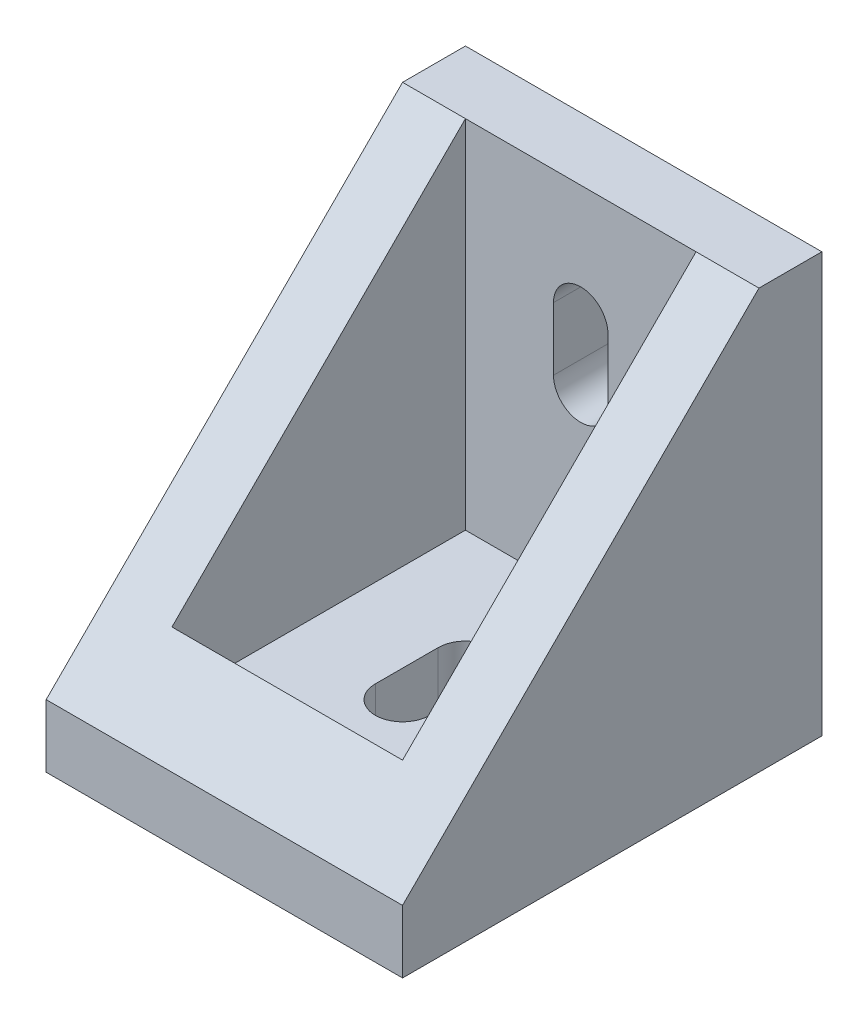
ISO-10303-21;
HEADER;
FILE_DESCRIPTION(('STEP AP214'),'2;1');
FILE_NAME('part.step','',(''),(''),'','','');
FILE_SCHEMA(('AUTOMOTIVE_DESIGN { 1 0 10303 214 1 1 1 1 }'));
ENDSEC;
DATA;
#1=APPLICATION_CONTEXT('core data for automotive mechanical design processes');
#2=APPLICATION_PROTOCOL_DEFINITION('international standard','automotive_design',2000,#1);
#3=PRODUCT_CONTEXT('',#1,'mechanical');
#4=PRODUCT('Part','Part','',(#3));
#5=PRODUCT_RELATED_PRODUCT_CATEGORY('part','',(#4));
#6=PRODUCT_DEFINITION_FORMATION('','',#4);
#7=PRODUCT_DEFINITION_CONTEXT('part definition',#1,'design');
#8=PRODUCT_DEFINITION('design','',#6,#7);
#9=PRODUCT_DEFINITION_SHAPE('','',#8);
#10=(LENGTH_UNIT() NAMED_UNIT(*) SI_UNIT(.MILLI.,.METRE.));
#11=(NAMED_UNIT(*) PLANE_ANGLE_UNIT() SI_UNIT($,.RADIAN.));
#12=(NAMED_UNIT(*) SI_UNIT($,.STERADIAN.) SOLID_ANGLE_UNIT());
#13=UNCERTAINTY_MEASURE_WITH_UNIT(LENGTH_MEASURE(1.E-05),#10,'distance_accuracy_value','');
#14=(GEOMETRIC_REPRESENTATION_CONTEXT(3) GLOBAL_UNCERTAINTY_ASSIGNED_CONTEXT((#13)) GLOBAL_UNIT_ASSIGNED_CONTEXT((#10,
#11,#12)) REPRESENTATION_CONTEXT('',''));
#15=CARTESIAN_POINT('',(0.,0.,0.));
#16=DIRECTION('',(0.,0.,1.));
#17=DIRECTION('',(1.,0.,0.));
#18=AXIS2_PLACEMENT_3D('',#15,#16,#17);
#19=CARTESIAN_POINT('',(8.5,20.,-10.));
#20=DIRECTION('',(-1.,0.,0.));
#21=DIRECTION('',(0.,0.,1.));
#22=AXIS2_PLACEMENT_3D('',#19,#20,#21);
#23=PLANE('',#22);
#24=DIRECTION('',(0.,0.,-1.));
#25=VECTOR('',#24,1.);
#26=CARTESIAN_POINT('',(8.5,20.,-10.));
#27=LINE('',#26,#25);
#28=CARTESIAN_POINT('',(8.5,20.,-7.));
#29=VERTEX_POINT('',#28);
#30=CARTESIAN_POINT('',(8.5,20.,-10.));
#31=VERTEX_POINT('',#30);
#32=EDGE_CURVE('E259',#29,#31,#27,.T.);
#33=ORIENTED_EDGE('',*,*,#32,.F.);
#34=DIRECTION('',(0.,0.707106781186547,-0.707106781186547));
#35=VECTOR('',#34,1.);
#36=CARTESIAN_POINT('',(8.5,3.,10.));
#37=LINE('',#36,#35);
#38=CARTESIAN_POINT('',(8.5,3.,10.));
#39=VERTEX_POINT('',#38);
#40=EDGE_CURVE('E213',#39,#29,#37,.T.);
#41=ORIENTED_EDGE('',*,*,#40,.F.);
#42=DIRECTION('',(0.,-1.,0.));
#43=VECTOR('',#42,1.);
#44=CARTESIAN_POINT('',(8.5,20.,10.));
#45=LINE('',#44,#43);
#46=CARTESIAN_POINT('',(8.5,0.,10.));
#47=VERTEX_POINT('',#46);
#48=EDGE_CURVE('E267',#39,#47,#45,.T.);
#49=ORIENTED_EDGE('',*,*,#48,.T.);
#50=DIRECTION('',(0.,0.,-1.));
#51=VECTOR('',#50,1.);
#52=CARTESIAN_POINT('',(8.5,0.,-10.));
#53=LINE('',#52,#51);
#54=CARTESIAN_POINT('',(8.5,0.,-10.));
#55=VERTEX_POINT('',#54);
#56=EDGE_CURVE('E241',#47,#55,#53,.T.);
#57=ORIENTED_EDGE('',*,*,#56,.T.);
#58=DIRECTION('',(0.,-1.,0.));
#59=VECTOR('',#58,1.);
#60=CARTESIAN_POINT('',(8.5,20.,-10.));
#61=LINE('',#60,#59);
#62=EDGE_CURVE('E41',#31,#55,#61,.T.);
#63=ORIENTED_EDGE('',*,*,#62,.F.);
#64=EDGE_LOOP('',(#33,#41,#49,#57,#63));
#65=FACE_BOUND('',#64,.T.);
#66=ADVANCED_FACE('F34',(#65),#23,.F.);
#67=CARTESIAN_POINT('',(-8.5,20.,-10.));
#68=DIRECTION('',(0.,0.,1.));
#69=DIRECTION('',(1.,0.,0.));
#70=AXIS2_PLACEMENT_3D('',#67,#68,#69);
#71=PLANE('',#70);
#72=DIRECTION('',(0.,1.,0.));
#73=VECTOR('',#72,1.);
#74=CARTESIAN_POINT('',(1.3,14.5,-10.));
#75=LINE('',#74,#73);
#76=CARTESIAN_POINT('',(1.3,11.5,-10.));
#77=VERTEX_POINT('',#76);
#78=CARTESIAN_POINT('',(1.3,14.5,-10.));
#79=VERTEX_POINT('',#78);
#80=EDGE_CURVE('E159',#77,#79,#75,.T.);
#81=ORIENTED_EDGE('',*,*,#80,.T.);
#82=CARTESIAN_POINT('',(0.,14.5,-10.));
#83=DIRECTION('',(0.,0.,1.));
#84=DIRECTION('',(1.,0.,0.));
#85=AXIS2_PLACEMENT_3D('',#82,#83,#84);
#86=CIRCLE('',#85,1.3);
#87=CARTESIAN_POINT('',(-1.3,14.5,-10.));
#88=VERTEX_POINT('',#87);
#89=EDGE_CURVE('E153',#79,#88,#86,.T.);
#90=ORIENTED_EDGE('',*,*,#89,.T.);
#91=DIRECTION('',(0.,-1.,0.));
#92=VECTOR('',#91,1.);
#93=CARTESIAN_POINT('',(-1.3,14.5,-10.));
#94=LINE('',#93,#92);
#95=CARTESIAN_POINT('',(-1.3,11.5,-10.));
#96=VERTEX_POINT('',#95);
#97=EDGE_CURVE('E162',#88,#96,#94,.T.);
#98=ORIENTED_EDGE('',*,*,#97,.T.);
#99=CARTESIAN_POINT('',(0.,11.5,-10.));
#100=DIRECTION('',(0.,0.,1.));
#101=DIRECTION('',(1.,0.,0.));
#102=AXIS2_PLACEMENT_3D('',#99,#100,#101);
#103=CIRCLE('',#102,1.3);
#104=EDGE_CURVE('E48',#96,#77,#103,.T.);
#105=ORIENTED_EDGE('',*,*,#104,.T.);
#106=EDGE_LOOP('',(#81,#90,#98,#105));
#107=FACE_BOUND('',#106,.T.);
#108=DIRECTION('',(-1.,0.,0.));
#109=VECTOR('',#108,1.);
#110=CARTESIAN_POINT('',(-8.5,0.,-10.));
#111=LINE('',#110,#109);
#112=CARTESIAN_POINT('',(-8.5,0.,-10.));
#113=VERTEX_POINT('',#112);
#114=EDGE_CURVE('E270',#55,#113,#111,.T.);
#115=ORIENTED_EDGE('',*,*,#114,.T.);
#116=DIRECTION('',(0.,-1.,0.));
#117=VECTOR('',#116,1.);
#118=CARTESIAN_POINT('',(-8.5,20.,-10.));
#119=LINE('',#118,#117);
#120=CARTESIAN_POINT('',(-8.5,20.,-10.));
#121=VERTEX_POINT('',#120);
#122=EDGE_CURVE('E280',#121,#113,#119,.T.);
#123=ORIENTED_EDGE('',*,*,#122,.F.);
#124=DIRECTION('',(-1.,0.,0.));
#125=VECTOR('',#124,1.);
#126=CARTESIAN_POINT('',(-8.5,20.,-10.));
#127=LINE('',#126,#125);
#128=EDGE_CURVE('E261',#31,#121,#127,.T.);
#129=ORIENTED_EDGE('',*,*,#128,.F.);
#130=ORIENTED_EDGE('',*,*,#62,.T.);
#131=EDGE_LOOP('',(#115,#123,#129,#130));
#132=FACE_BOUND('',#131,.T.);
#133=ADVANCED_FACE('F166',(#107,#132),#71,.F.);
#134=CARTESIAN_POINT('',(-8.5,20.,-10.));
#135=DIRECTION('',(1.,0.,0.));
#136=DIRECTION('',(0.,0.,-1.));
#137=AXIS2_PLACEMENT_3D('',#134,#135,#136);
#138=PLANE('',#137);
#139=DIRECTION('',(0.,-1.,0.));
#140=VECTOR('',#139,1.);
#141=CARTESIAN_POINT('',(-8.5,20.,10.));
#142=LINE('',#141,#140);
#143=CARTESIAN_POINT('',(-8.5,3.,10.));
#144=VERTEX_POINT('',#143);
#145=CARTESIAN_POINT('',(-8.5,0.,10.));
#146=VERTEX_POINT('',#145);
#147=EDGE_CURVE('E278',#144,#146,#142,.T.);
#148=ORIENTED_EDGE('',*,*,#147,.F.);
#149=DIRECTION('',(0.,0.707106781186547,-0.707106781186547));
#150=VECTOR('',#149,1.);
#151=CARTESIAN_POINT('',(-8.5,3.,10.));
#152=LINE('',#151,#150);
#153=CARTESIAN_POINT('',(-8.5,20.,-7.));
#154=VERTEX_POINT('',#153);
#155=EDGE_CURVE('E220',#144,#154,#152,.T.);
#156=ORIENTED_EDGE('',*,*,#155,.T.);
#157=DIRECTION('',(0.,0.,1.));
#158=VECTOR('',#157,1.);
#159=CARTESIAN_POINT('',(-8.5,20.,-10.));
#160=LINE('',#159,#158);
#161=EDGE_CURVE('E264',#121,#154,#160,.T.);
#162=ORIENTED_EDGE('',*,*,#161,.F.);
#163=ORIENTED_EDGE('',*,*,#122,.T.);
#164=DIRECTION('',(0.,0.,1.));
#165=VECTOR('',#164,1.);
#166=CARTESIAN_POINT('',(-8.5,0.,-10.));
#167=LINE('',#166,#165);
#168=EDGE_CURVE('E272',#113,#146,#167,.T.);
#169=ORIENTED_EDGE('',*,*,#168,.T.);
#170=EDGE_LOOP('',(#148,#156,#162,#163,#169));
#171=FACE_BOUND('',#170,.T.);
#172=ADVANCED_FACE('F297',(#171),#138,.F.);
#173=CARTESIAN_POINT('',(-8.5,20.,10.));
#174=DIRECTION('',(0.,0.,-1.));
#175=DIRECTION('',(-1.,0.,0.));
#176=AXIS2_PLACEMENT_3D('',#173,#174,#175);
#177=PLANE('',#176);
#178=ORIENTED_EDGE('',*,*,#48,.F.);
#179=DIRECTION('',(1.,0.,0.));
#180=VECTOR('',#179,1.);
#181=CARTESIAN_POINT('',(-8.5,3.,10.));
#182=LINE('',#181,#180);
#183=EDGE_CURVE('E225',#144,#39,#182,.T.);
#184=ORIENTED_EDGE('',*,*,#183,.F.);
#185=ORIENTED_EDGE('',*,*,#147,.T.);
#186=DIRECTION('',(1.,0.,0.));
#187=VECTOR('',#186,1.);
#188=CARTESIAN_POINT('',(-8.5,0.,10.));
#189=LINE('',#188,#187);
#190=EDGE_CURVE('E262',#146,#47,#189,.T.);
#191=ORIENTED_EDGE('',*,*,#190,.T.);
#192=EDGE_LOOP('',(#178,#184,#185,#191));
#193=FACE_BOUND('',#192,.T.);
#194=ADVANCED_FACE('F306',(#193),#177,.F.);
#195=CARTESIAN_POINT('',(0.,20.,0.));
#196=DIRECTION('',(0.,1.,0.));
#197=DIRECTION('',(0.,0.,1.));
#198=AXIS2_PLACEMENT_3D('',#195,#196,#197);
#199=PLANE('',#198);
#200=DIRECTION('',(1.,0.,0.));
#201=VECTOR('',#200,1.);
#202=CARTESIAN_POINT('',(-8.5,20.,-7.));
#203=LINE('',#202,#201);
#204=CARTESIAN_POINT('',(5.5,20.,-7.));
#205=VERTEX_POINT('',#204);
#206=EDGE_CURVE('E223',#205,#29,#203,.T.);
#207=ORIENTED_EDGE('',*,*,#206,.T.);
#208=ORIENTED_EDGE('',*,*,#32,.T.);
#209=ORIENTED_EDGE('',*,*,#128,.T.);
#210=ORIENTED_EDGE('',*,*,#161,.T.);
#211=CARTESIAN_POINT('',(-5.5,20.,-7.));
#212=VERTEX_POINT('',#211);
#213=EDGE_CURVE('E228',#154,#212,#203,.T.);
#214=ORIENTED_EDGE('',*,*,#213,.T.);
#215=DIRECTION('',(-1.,0.,0.));
#216=VECTOR('',#215,1.);
#217=CARTESIAN_POINT('',(-8.5,20.,-7.));
#218=LINE('',#217,#216);
#219=EDGE_CURVE('E246',#205,#212,#218,.T.);
#220=ORIENTED_EDGE('',*,*,#219,.F.);
#221=EDGE_LOOP('',(#207,#208,#209,#210,#214,#220));
#222=FACE_BOUND('',#221,.T.);
#223=ADVANCED_FACE('F301',(#222),#199,.T.);
#224=CARTESIAN_POINT('',(0.,0.,0.));
#225=DIRECTION('',(0.,1.,0.));
#226=DIRECTION('',(0.,0.,1.));
#227=AXIS2_PLACEMENT_3D('',#224,#225,#226);
#228=PLANE('',#227);
#229=DIRECTION('',(0.,0.,-1.));
#230=VECTOR('',#229,1.);
#231=CARTESIAN_POINT('',(1.3,0.,-1.5));
#232=LINE('',#231,#230);
#233=CARTESIAN_POINT('',(1.3,0.,1.5));
#234=VERTEX_POINT('',#233);
#235=CARTESIAN_POINT('',(1.3,0.,-1.5));
#236=VERTEX_POINT('',#235);
#237=EDGE_CURVE('E198',#234,#236,#232,.T.);
#238=ORIENTED_EDGE('',*,*,#237,.T.);
#239=CARTESIAN_POINT('',(0.,0.,-1.5));
#240=DIRECTION('',(0.,1.,0.));
#241=DIRECTION('',(0.,0.,1.));
#242=AXIS2_PLACEMENT_3D('',#239,#240,#241);
#243=CIRCLE('',#242,1.3);
#244=CARTESIAN_POINT('',(-1.3,0.,-1.5));
#245=VERTEX_POINT('',#244);
#246=EDGE_CURVE('E188',#236,#245,#243,.T.);
#247=ORIENTED_EDGE('',*,*,#246,.T.);
#248=DIRECTION('',(0.,0.,1.));
#249=VECTOR('',#248,1.);
#250=CARTESIAN_POINT('',(-1.3,0.,-1.5));
#251=LINE('',#250,#249);
#252=CARTESIAN_POINT('',(-1.3,0.,1.5));
#253=VERTEX_POINT('',#252);
#254=EDGE_CURVE('E191',#245,#253,#251,.T.);
#255=ORIENTED_EDGE('',*,*,#254,.T.);
#256=CARTESIAN_POINT('',(0.,0.,1.5));
#257=DIRECTION('',(0.,1.,0.));
#258=DIRECTION('',(0.,0.,1.));
#259=AXIS2_PLACEMENT_3D('',#256,#257,#258);
#260=CIRCLE('',#259,1.3);
#261=EDGE_CURVE('E195',#253,#234,#260,.T.);
#262=ORIENTED_EDGE('',*,*,#261,.T.);
#263=EDGE_LOOP('',(#238,#247,#255,#262));
#264=FACE_BOUND('',#263,.T.);
#265=ORIENTED_EDGE('',*,*,#56,.F.);
#266=ORIENTED_EDGE('',*,*,#190,.F.);
#267=ORIENTED_EDGE('',*,*,#168,.F.);
#268=ORIENTED_EDGE('',*,*,#114,.F.);
#269=EDGE_LOOP('',(#265,#266,#267,#268));
#270=FACE_BOUND('',#269,.T.);
#271=ADVANCED_FACE('F293',(#264,#270),#228,.F.);
#272=CARTESIAN_POINT('',(5.5,20.,-10.));
#273=DIRECTION('',(-1.,0.,0.));
#274=DIRECTION('',(0.,0.,1.));
#275=AXIS2_PLACEMENT_3D('',#272,#273,#274);
#276=PLANE('',#275);
#277=DIRECTION('',(0.,-0.707106781186548,0.707106781186548));
#278=VECTOR('',#277,1.);
#279=CARTESIAN_POINT('',(5.5,21.5,-8.5));
#280=LINE('',#279,#278);
#281=CARTESIAN_POINT('',(5.5,6.,7.));
#282=VERTEX_POINT('',#281);
#283=EDGE_CURVE('E232',#205,#282,#280,.T.);
#284=ORIENTED_EDGE('',*,*,#283,.F.);
#285=DIRECTION('',(0.,-1.,0.));
#286=VECTOR('',#285,1.);
#287=CARTESIAN_POINT('',(5.5,20.,-7.));
#288=LINE('',#287,#286);
#289=CARTESIAN_POINT('',(5.5,3.,-7.));
#290=VERTEX_POINT('',#289);
#291=EDGE_CURVE('E238',#205,#290,#288,.T.);
#292=ORIENTED_EDGE('',*,*,#291,.T.);
#293=DIRECTION('',(0.,0.,-1.));
#294=VECTOR('',#293,1.);
#295=CARTESIAN_POINT('',(5.5,3.,-10.));
#296=LINE('',#295,#294);
#297=CARTESIAN_POINT('',(5.5,3.,7.));
#298=VERTEX_POINT('',#297);
#299=EDGE_CURVE('E234',#298,#290,#296,.T.);
#300=ORIENTED_EDGE('',*,*,#299,.F.);
#301=DIRECTION('',(0.,-1.,0.));
#302=VECTOR('',#301,1.);
#303=CARTESIAN_POINT('',(5.5,20.,7.));
#304=LINE('',#303,#302);
#305=EDGE_CURVE('E243',#282,#298,#304,.T.);
#306=ORIENTED_EDGE('',*,*,#305,.F.);
#307=EDGE_LOOP('',(#284,#292,#300,#306));
#308=FACE_BOUND('',#307,.T.);
#309=ADVANCED_FACE('F324',(#308),#276,.T.);
#310=CARTESIAN_POINT('',(-8.5,20.,-7.));
#311=DIRECTION('',(0.,0.,1.));
#312=DIRECTION('',(1.,0.,0.));
#313=AXIS2_PLACEMENT_3D('',#310,#311,#312);
#314=PLANE('',#313);
#315=CARTESIAN_POINT('',(0.,14.5,-7.));
#316=DIRECTION('',(0.,0.,1.));
#317=DIRECTION('',(1.,0.,0.));
#318=AXIS2_PLACEMENT_3D('',#315,#316,#317);
#319=CIRCLE('',#318,1.3);
#320=CARTESIAN_POINT('',(1.3,14.5,-7.));
#321=VERTEX_POINT('',#320);
#322=CARTESIAN_POINT('',(-1.3,14.5,-7.));
#323=VERTEX_POINT('',#322);
#324=EDGE_CURVE('E56',#321,#323,#319,.T.);
#325=ORIENTED_EDGE('',*,*,#324,.F.);
#326=DIRECTION('',(0.,1.,0.));
#327=VECTOR('',#326,1.);
#328=CARTESIAN_POINT('',(1.3,14.5,-7.));
#329=LINE('',#328,#327);
#330=CARTESIAN_POINT('',(1.3,11.5,-7.));
#331=VERTEX_POINT('',#330);
#332=EDGE_CURVE('E169',#331,#321,#329,.T.);
#333=ORIENTED_EDGE('',*,*,#332,.F.);
#334=CARTESIAN_POINT('',(0.,11.5,-7.));
#335=DIRECTION('',(0.,0.,1.));
#336=DIRECTION('',(1.,0.,0.));
#337=AXIS2_PLACEMENT_3D('',#334,#335,#336);
#338=CIRCLE('',#337,1.3);
#339=CARTESIAN_POINT('',(-1.3,11.5,-7.));
#340=VERTEX_POINT('',#339);
#341=EDGE_CURVE('E172',#340,#331,#338,.T.);
#342=ORIENTED_EDGE('',*,*,#341,.F.);
#343=DIRECTION('',(0.,-1.,0.));
#344=VECTOR('',#343,1.);
#345=CARTESIAN_POINT('',(-1.3,14.5,-7.));
#346=LINE('',#345,#344);
#347=EDGE_CURVE('E178',#323,#340,#346,.T.);
#348=ORIENTED_EDGE('',*,*,#347,.F.);
#349=EDGE_LOOP('',(#325,#333,#342,#348));
#350=FACE_BOUND('',#349,.T.);
#351=DIRECTION('',(-1.,0.,0.));
#352=VECTOR('',#351,1.);
#353=CARTESIAN_POINT('',(-8.5,3.,-7.));
#354=LINE('',#353,#352);
#355=CARTESIAN_POINT('',(-5.5,3.,-7.));
#356=VERTEX_POINT('',#355);
#357=EDGE_CURVE('E237',#290,#356,#354,.T.);
#358=ORIENTED_EDGE('',*,*,#357,.F.);
#359=ORIENTED_EDGE('',*,*,#291,.F.);
#360=ORIENTED_EDGE('',*,*,#219,.T.);
#361=DIRECTION('',(0.,-1.,0.));
#362=VECTOR('',#361,1.);
#363=CARTESIAN_POINT('',(-5.5,20.,-7.));
#364=LINE('',#363,#362);
#365=EDGE_CURVE('E242',#212,#356,#364,.T.);
#366=ORIENTED_EDGE('',*,*,#365,.T.);
#367=EDGE_LOOP('',(#358,#359,#360,#366));
#368=FACE_BOUND('',#367,.T.);
#369=ADVANCED_FACE('F327',(#350,#368),#314,.T.);
#370=CARTESIAN_POINT('',(-5.5,20.,-10.));
#371=DIRECTION('',(1.,0.,0.));
#372=DIRECTION('',(0.,0.,-1.));
#373=AXIS2_PLACEMENT_3D('',#370,#371,#372);
#374=PLANE('',#373);
#375=DIRECTION('',(0.,0.707106781186548,-0.707106781186548));
#376=VECTOR('',#375,1.);
#377=CARTESIAN_POINT('',(-5.5,21.5,-8.5));
#378=LINE('',#377,#376);
#379=CARTESIAN_POINT('',(-5.5,6.,7.));
#380=VERTEX_POINT('',#379);
#381=EDGE_CURVE('E227',#380,#212,#378,.T.);
#382=ORIENTED_EDGE('',*,*,#381,.F.);
#383=DIRECTION('',(0.,-1.,0.));
#384=VECTOR('',#383,1.);
#385=CARTESIAN_POINT('',(-5.5,20.,7.));
#386=LINE('',#385,#384);
#387=CARTESIAN_POINT('',(-5.5,3.,7.));
#388=VERTEX_POINT('',#387);
#389=EDGE_CURVE('E245',#380,#388,#386,.T.);
#390=ORIENTED_EDGE('',*,*,#389,.T.);
#391=DIRECTION('',(0.,0.,1.));
#392=VECTOR('',#391,1.);
#393=CARTESIAN_POINT('',(-5.5,3.,-10.));
#394=LINE('',#393,#392);
#395=EDGE_CURVE('E248',#356,#388,#394,.T.);
#396=ORIENTED_EDGE('',*,*,#395,.F.);
#397=ORIENTED_EDGE('',*,*,#365,.F.);
#398=EDGE_LOOP('',(#382,#390,#396,#397));
#399=FACE_BOUND('',#398,.T.);
#400=ADVANCED_FACE('F313',(#399),#374,.T.);
#401=CARTESIAN_POINT('',(-8.5,20.,7.));
#402=DIRECTION('',(0.,0.,-1.));
#403=DIRECTION('',(-1.,0.,0.));
#404=AXIS2_PLACEMENT_3D('',#401,#402,#403);
#405=PLANE('',#404);
#406=DIRECTION('',(-1.,0.,0.));
#407=VECTOR('',#406,1.);
#408=CARTESIAN_POINT('',(-8.5,6.,7.));
#409=LINE('',#408,#407);
#410=EDGE_CURVE('E11',#282,#380,#409,.T.);
#411=ORIENTED_EDGE('',*,*,#410,.F.);
#412=ORIENTED_EDGE('',*,*,#305,.T.);
#413=DIRECTION('',(1.,0.,0.));
#414=VECTOR('',#413,1.);
#415=CARTESIAN_POINT('',(-8.5,3.,7.));
#416=LINE('',#415,#414);
#417=EDGE_CURVE('E253',#388,#298,#416,.T.);
#418=ORIENTED_EDGE('',*,*,#417,.F.);
#419=ORIENTED_EDGE('',*,*,#389,.F.);
#420=EDGE_LOOP('',(#411,#412,#418,#419));
#421=FACE_BOUND('',#420,.T.);
#422=ADVANCED_FACE('F317',(#421),#405,.T.);
#423=CARTESIAN_POINT('',(0.,3.,0.));
#424=DIRECTION('',(0.,1.,0.));
#425=DIRECTION('',(0.,0.,1.));
#426=AXIS2_PLACEMENT_3D('',#423,#424,#425);
#427=PLANE('',#426);
#428=CARTESIAN_POINT('',(0.,3.,-1.5));
#429=DIRECTION('',(0.,1.,0.));
#430=DIRECTION('',(0.,0.,1.));
#431=AXIS2_PLACEMENT_3D('',#428,#429,#430);
#432=CIRCLE('',#431,1.3);
#433=CARTESIAN_POINT('',(1.3,3.,-1.5));
#434=VERTEX_POINT('',#433);
#435=CARTESIAN_POINT('',(-1.3,3.,-1.5));
#436=VERTEX_POINT('',#435);
#437=EDGE_CURVE('E184',#434,#436,#432,.T.);
#438=ORIENTED_EDGE('',*,*,#437,.F.);
#439=DIRECTION('',(0.,0.,-1.));
#440=VECTOR('',#439,1.);
#441=CARTESIAN_POINT('',(1.3,3.,-1.5));
#442=LINE('',#441,#440);
#443=CARTESIAN_POINT('',(1.3,3.,1.5));
#444=VERTEX_POINT('',#443);
#445=EDGE_CURVE('E192',#444,#434,#442,.T.);
#446=ORIENTED_EDGE('',*,*,#445,.F.);
#447=CARTESIAN_POINT('',(0.,3.,1.5));
#448=DIRECTION('',(0.,1.,0.));
#449=DIRECTION('',(0.,0.,1.));
#450=AXIS2_PLACEMENT_3D('',#447,#448,#449);
#451=CIRCLE('',#450,1.3);
#452=CARTESIAN_POINT('',(-1.3,3.,1.5));
#453=VERTEX_POINT('',#452);
#454=EDGE_CURVE('E207',#453,#444,#451,.T.);
#455=ORIENTED_EDGE('',*,*,#454,.F.);
#456=DIRECTION('',(0.,0.,1.));
#457=VECTOR('',#456,1.);
#458=CARTESIAN_POINT('',(-1.3,3.,-1.5));
#459=LINE('',#458,#457);
#460=EDGE_CURVE('E204',#436,#453,#459,.T.);
#461=ORIENTED_EDGE('',*,*,#460,.F.);
#462=EDGE_LOOP('',(#438,#446,#455,#461));
#463=FACE_BOUND('',#462,.T.);
#464=ORIENTED_EDGE('',*,*,#299,.T.);
#465=ORIENTED_EDGE('',*,*,#357,.T.);
#466=ORIENTED_EDGE('',*,*,#395,.T.);
#467=ORIENTED_EDGE('',*,*,#417,.T.);
#468=EDGE_LOOP('',(#464,#465,#466,#467));
#469=FACE_BOUND('',#468,.T.);
#470=ADVANCED_FACE('F321',(#463,#469),#427,.T.);
#471=CARTESIAN_POINT('',(-8.5,3.,10.));
#472=DIRECTION('',(0.,-0.707106781186548,-0.707106781186548));
#473=DIRECTION('',(0.,0.707106781186548,-0.707106781186548));
#474=AXIS2_PLACEMENT_3D('',#471,#472,#473);
#475=PLANE('',#474);
#476=ORIENTED_EDGE('',*,*,#283,.T.);
#477=ORIENTED_EDGE('',*,*,#410,.T.);
#478=ORIENTED_EDGE('',*,*,#381,.T.);
#479=ORIENTED_EDGE('',*,*,#213,.F.);
#480=ORIENTED_EDGE('',*,*,#155,.F.);
#481=ORIENTED_EDGE('',*,*,#183,.T.);
#482=ORIENTED_EDGE('',*,*,#40,.T.);
#483=ORIENTED_EDGE('',*,*,#206,.F.);
#484=EDGE_LOOP('',(#476,#477,#478,#479,#480,#481,#482,#483));
#485=FACE_BOUND('',#484,.T.);
#486=ADVANCED_FACE('F307',(#485),#475,.F.);
#487=CARTESIAN_POINT('',(0.,0.,-1.5));
#488=DIRECTION('',(0.,1.,0.));
#489=DIRECTION('',(0.,0.,1.));
#490=AXIS2_PLACEMENT_3D('',#487,#488,#489);
#491=CYLINDRICAL_SURFACE('',#490,1.3);
#492=ORIENTED_EDGE('',*,*,#437,.T.);
#493=DIRECTION('',(0.,1.,0.));
#494=VECTOR('',#493,1.);
#495=CARTESIAN_POINT('',(-1.3,0.,-1.5));
#496=LINE('',#495,#494);
#497=EDGE_CURVE('E201',#245,#436,#496,.T.);
#498=ORIENTED_EDGE('',*,*,#497,.F.);
#499=ORIENTED_EDGE('',*,*,#246,.F.);
#500=DIRECTION('',(0.,1.,0.));
#501=VECTOR('',#500,1.);
#502=CARTESIAN_POINT('',(1.3,0.,-1.5));
#503=LINE('',#502,#501);
#504=EDGE_CURVE('E211',#236,#434,#503,.T.);
#505=ORIENTED_EDGE('',*,*,#504,.T.);
#506=EDGE_LOOP('',(#492,#498,#499,#505));
#507=FACE_BOUND('',#506,.T.);
#508=ADVANCED_FACE('F373',(#507),#491,.F.);
#509=CARTESIAN_POINT('',(1.3,0.,-1.5));
#510=DIRECTION('',(1.,0.,0.));
#511=DIRECTION('',(0.,0.,-1.));
#512=AXIS2_PLACEMENT_3D('',#509,#510,#511);
#513=PLANE('',#512);
#514=ORIENTED_EDGE('',*,*,#445,.T.);
#515=ORIENTED_EDGE('',*,*,#504,.F.);
#516=ORIENTED_EDGE('',*,*,#237,.F.);
#517=DIRECTION('',(0.,1.,0.));
#518=VECTOR('',#517,1.);
#519=CARTESIAN_POINT('',(1.3,0.,1.5));
#520=LINE('',#519,#518);
#521=EDGE_CURVE('E214',#234,#444,#520,.T.);
#522=ORIENTED_EDGE('',*,*,#521,.T.);
#523=EDGE_LOOP('',(#514,#515,#516,#522));
#524=FACE_BOUND('',#523,.T.);
#525=ADVANCED_FACE('F379',(#524),#513,.F.);
#526=CARTESIAN_POINT('',(0.,0.,1.5));
#527=DIRECTION('',(0.,1.,0.));
#528=DIRECTION('',(0.,0.,1.));
#529=AXIS2_PLACEMENT_3D('',#526,#527,#528);
#530=CYLINDRICAL_SURFACE('',#529,1.3);
#531=ORIENTED_EDGE('',*,*,#454,.T.);
#532=ORIENTED_EDGE('',*,*,#521,.F.);
#533=ORIENTED_EDGE('',*,*,#261,.F.);
#534=DIRECTION('',(0.,1.,0.));
#535=VECTOR('',#534,1.);
#536=CARTESIAN_POINT('',(-1.3,0.,1.5));
#537=LINE('',#536,#535);
#538=EDGE_CURVE('E217',#253,#453,#537,.T.);
#539=ORIENTED_EDGE('',*,*,#538,.T.);
#540=EDGE_LOOP('',(#531,#532,#533,#539));
#541=FACE_BOUND('',#540,.T.);
#542=ADVANCED_FACE('F387',(#541),#530,.F.);
#543=CARTESIAN_POINT('',(-1.3,0.,-1.5));
#544=DIRECTION('',(-1.,0.,0.));
#545=DIRECTION('',(0.,0.,1.));
#546=AXIS2_PLACEMENT_3D('',#543,#544,#545);
#547=PLANE('',#546);
#548=ORIENTED_EDGE('',*,*,#460,.T.);
#549=ORIENTED_EDGE('',*,*,#538,.F.);
#550=ORIENTED_EDGE('',*,*,#254,.F.);
#551=ORIENTED_EDGE('',*,*,#497,.T.);
#552=EDGE_LOOP('',(#548,#549,#550,#551));
#553=FACE_BOUND('',#552,.T.);
#554=ADVANCED_FACE('F395',(#553),#547,.F.);
#555=CARTESIAN_POINT('',(0.,14.5,-10.));
#556=DIRECTION('',(0.,0.,1.));
#557=DIRECTION('',(1.,0.,0.));
#558=AXIS2_PLACEMENT_3D('',#555,#556,#557);
#559=CYLINDRICAL_SURFACE('',#558,1.3);
#560=ORIENTED_EDGE('',*,*,#324,.T.);
#561=DIRECTION('',(0.,0.,1.));
#562=VECTOR('',#561,1.);
#563=CARTESIAN_POINT('',(-1.3,14.5,-10.));
#564=LINE('',#563,#562);
#565=EDGE_CURVE('E149',#88,#323,#564,.T.);
#566=ORIENTED_EDGE('',*,*,#565,.F.);
#567=ORIENTED_EDGE('',*,*,#89,.F.);
#568=DIRECTION('',(0.,0.,1.));
#569=VECTOR('',#568,1.);
#570=CARTESIAN_POINT('',(1.3,14.5,-10.));
#571=LINE('',#570,#569);
#572=EDGE_CURVE('E182',#79,#321,#571,.T.);
#573=ORIENTED_EDGE('',*,*,#572,.T.);
#574=EDGE_LOOP('',(#560,#566,#567,#573));
#575=FACE_BOUND('',#574,.T.);
#576=ADVANCED_FACE('F151',(#575),#559,.F.);
#577=CARTESIAN_POINT('',(1.3,14.5,-10.));
#578=DIRECTION('',(1.,0.,0.));
#579=DIRECTION('',(0.,0.,-1.));
#580=AXIS2_PLACEMENT_3D('',#577,#578,#579);
#581=PLANE('',#580);
#582=ORIENTED_EDGE('',*,*,#332,.T.);
#583=ORIENTED_EDGE('',*,*,#572,.F.);
#584=ORIENTED_EDGE('',*,*,#80,.F.);
#585=DIRECTION('',(0.,0.,1.));
#586=VECTOR('',#585,1.);
#587=CARTESIAN_POINT('',(1.3,11.5,-10.));
#588=LINE('',#587,#586);
#589=EDGE_CURVE('E185',#77,#331,#588,.T.);
#590=ORIENTED_EDGE('',*,*,#589,.T.);
#591=EDGE_LOOP('',(#582,#583,#584,#590));
#592=FACE_BOUND('',#591,.T.);
#593=ADVANCED_FACE('F410',(#592),#581,.F.);
#594=CARTESIAN_POINT('',(0.,11.5,-10.));
#595=DIRECTION('',(0.,0.,1.));
#596=DIRECTION('',(1.,0.,0.));
#597=AXIS2_PLACEMENT_3D('',#594,#595,#596);
#598=CYLINDRICAL_SURFACE('',#597,1.3);
#599=ORIENTED_EDGE('',*,*,#341,.T.);
#600=ORIENTED_EDGE('',*,*,#589,.F.);
#601=ORIENTED_EDGE('',*,*,#104,.F.);
#602=DIRECTION('',(0.,0.,1.));
#603=VECTOR('',#602,1.);
#604=CARTESIAN_POINT('',(-1.3,11.5,-10.));
#605=LINE('',#604,#603);
#606=EDGE_CURVE('E158',#96,#340,#605,.T.);
#607=ORIENTED_EDGE('',*,*,#606,.T.);
#608=EDGE_LOOP('',(#599,#600,#601,#607));
#609=FACE_BOUND('',#608,.T.);
#610=ADVANCED_FACE('F417',(#609),#598,.F.);
#611=CARTESIAN_POINT('',(-1.3,14.5,-10.));
#612=DIRECTION('',(-1.,0.,0.));
#613=DIRECTION('',(0.,0.,1.));
#614=AXIS2_PLACEMENT_3D('',#611,#612,#613);
#615=PLANE('',#614);
#616=ORIENTED_EDGE('',*,*,#347,.T.);
#617=ORIENTED_EDGE('',*,*,#606,.F.);
#618=ORIENTED_EDGE('',*,*,#97,.F.);
#619=ORIENTED_EDGE('',*,*,#565,.T.);
#620=EDGE_LOOP('',(#616,#617,#618,#619));
#621=FACE_BOUND('',#620,.T.);
#622=ADVANCED_FACE('F163',(#621),#615,.F.);
#623=CLOSED_SHELL('',(#66,#133,#172,#194,#223,#271,#309,#369,#400,#422,#470,#486,#508,#525,#542,
#554,#576,#593,#610,#622));
#624=MANIFOLD_SOLID_BREP('B2',#623);
#625=ADVANCED_BREP_SHAPE_REPRESENTATION('',(#18,#624),#14);
#626=SHAPE_DEFINITION_REPRESENTATION(#9,#625);
ENDSEC;
END-ISO-10303-21;
